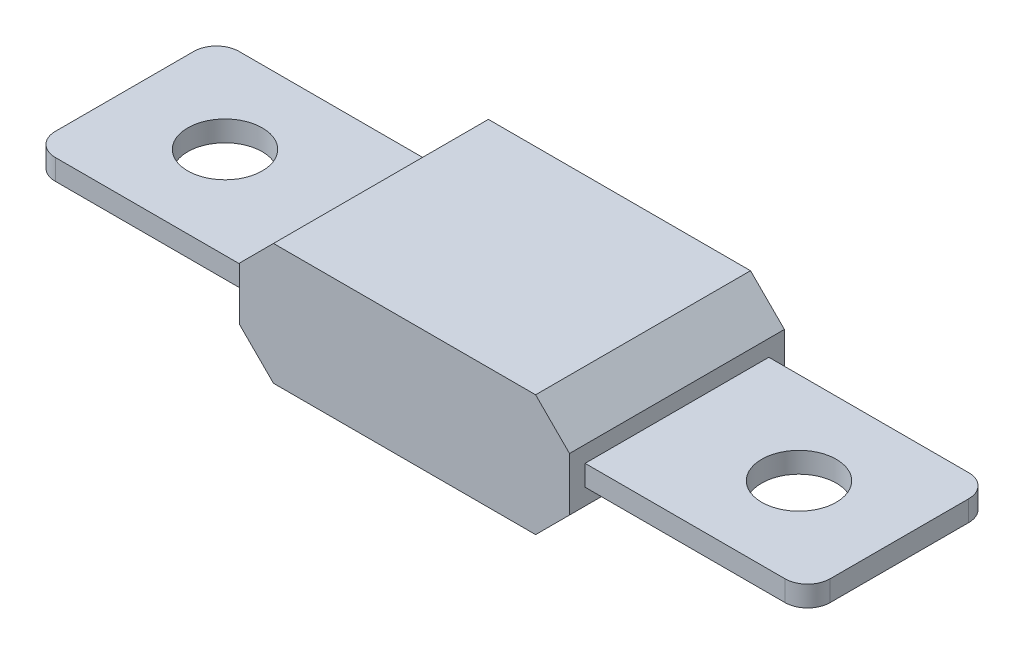
ISO-10303-21;
HEADER;
FILE_DESCRIPTION(('STEP AP214'),'2;1');
FILE_NAME('part.step','',(''),(''),'','','');
FILE_SCHEMA(('AUTOMOTIVE_DESIGN { 1 0 10303 214 1 1 1 1 }'));
ENDSEC;
DATA;
#1=APPLICATION_CONTEXT('core data for automotive mechanical design processes');
#2=APPLICATION_PROTOCOL_DEFINITION('international standard','automotive_design',2000,#1);
#3=PRODUCT_CONTEXT('',#1,'mechanical');
#4=PRODUCT('Part','Part','',(#3));
#5=PRODUCT_RELATED_PRODUCT_CATEGORY('part','',(#4));
#6=PRODUCT_DEFINITION_FORMATION('','',#4);
#7=PRODUCT_DEFINITION_CONTEXT('part definition',#1,'design');
#8=PRODUCT_DEFINITION('design','',#6,#7);
#9=PRODUCT_DEFINITION_SHAPE('','',#8);
#10=(LENGTH_UNIT() NAMED_UNIT(*) SI_UNIT(.MILLI.,.METRE.));
#11=(NAMED_UNIT(*) PLANE_ANGLE_UNIT() SI_UNIT($,.RADIAN.));
#12=(NAMED_UNIT(*) SI_UNIT($,.STERADIAN.) SOLID_ANGLE_UNIT());
#13=UNCERTAINTY_MEASURE_WITH_UNIT(LENGTH_MEASURE(1.E-05),#10,'distance_accuracy_value','');
#14=(GEOMETRIC_REPRESENTATION_CONTEXT(3) GLOBAL_UNCERTAINTY_ASSIGNED_CONTEXT((#13)) GLOBAL_UNIT_ASSIGNED_CONTEXT((#10,
#11,#12)) REPRESENTATION_CONTEXT('',''));
#15=CARTESIAN_POINT('',(0.,0.,0.));
#16=DIRECTION('',(0.,0.,1.));
#17=DIRECTION('',(1.,0.,0.));
#18=AXIS2_PLACEMENT_3D('',#15,#16,#17);
#19=CARTESIAN_POINT('',(-32.29,1.83,-6.13));
#20=DIRECTION('',(0.,1.,0.));
#21=DIRECTION('',(0.,0.,1.));
#22=AXIS2_PLACEMENT_3D('',#19,#20,#21);
#23=PLANE('',#22);
#24=DIRECTION('',(0.,0.,-1.));
#25=VECTOR('',#24,1.);
#26=CARTESIAN_POINT('',(14.6,1.83,-6.13));
#27=LINE('',#26,#25);
#28=CARTESIAN_POINT('',(14.6,1.83,8.13));
#29=VERTEX_POINT('',#28);
#30=CARTESIAN_POINT('',(14.6,1.83,-8.13));
#31=VERTEX_POINT('',#30);
#32=EDGE_CURVE('E47',#29,#31,#27,.T.);
#33=ORIENTED_EDGE('',*,*,#32,.F.);
#34=DIRECTION('',(1.,0.,0.));
#35=VECTOR('',#34,1.);
#36=CARTESIAN_POINT('',(-32.29,1.83,8.13));
#37=LINE('',#36,#35);
#38=CARTESIAN_POINT('',(32.29,1.83,8.13));
#39=VERTEX_POINT('',#38);
#40=EDGE_CURVE('E276',#29,#39,#37,.T.);
#41=ORIENTED_EDGE('',*,*,#40,.T.);
#42=CARTESIAN_POINT('',(32.29,1.83,6.13));
#43=DIRECTION('',(0.,1.,0.));
#44=DIRECTION('',(0.,0.,1.));
#45=AXIS2_PLACEMENT_3D('',#42,#43,#44);
#46=CIRCLE('',#45,2.);
#47=CARTESIAN_POINT('',(34.29,1.83,6.12999999999998));
#48=VERTEX_POINT('',#47);
#49=EDGE_CURVE('E280',#39,#48,#46,.T.);
#50=ORIENTED_EDGE('',*,*,#49,.T.);
#51=DIRECTION('',(0.,0.,-1.));
#52=VECTOR('',#51,1.);
#53=CARTESIAN_POINT('',(34.29,1.83,-6.12999999999999));
#54=LINE('',#53,#52);
#55=CARTESIAN_POINT('',(34.29,1.83,-6.12999999999999));
#56=VERTEX_POINT('',#55);
#57=EDGE_CURVE('E282',#48,#56,#54,.T.);
#58=ORIENTED_EDGE('',*,*,#57,.T.);
#59=CARTESIAN_POINT('',(32.29,1.83,-6.13));
#60=DIRECTION('',(0.,1.,0.));
#61=DIRECTION('',(0.,0.,-1.));
#62=AXIS2_PLACEMENT_3D('',#59,#60,#61);
#63=CIRCLE('',#62,2.);
#64=CARTESIAN_POINT('',(32.29,1.83,-8.13));
#65=VERTEX_POINT('',#64);
#66=EDGE_CURVE('E284',#56,#65,#63,.T.);
#67=ORIENTED_EDGE('',*,*,#66,.T.);
#68=DIRECTION('',(-1.,0.,0.));
#69=VECTOR('',#68,1.);
#70=CARTESIAN_POINT('',(-32.29,1.83,-8.13));
#71=LINE('',#70,#69);
#72=EDGE_CURVE('E287',#65,#31,#71,.T.);
#73=ORIENTED_EDGE('',*,*,#72,.T.);
#74=EDGE_LOOP('',(#33,#41,#50,#58,#67,#73));
#75=FACE_BOUND('',#74,.T.);
#76=CARTESIAN_POINT('',(25.4,1.83,0.));
#77=DIRECTION('',(0.,1.,0.));
#78=DIRECTION('',(0.,0.,1.));
#79=AXIS2_PLACEMENT_3D('',#76,#77,#78);
#80=CIRCLE('',#79,3.3);
#81=CARTESIAN_POINT('',(25.4,1.83,3.3));
#82=VERTEX_POINT('',#81);
#83=EDGE_CURVE('E262',#82,#82,#80,.T.);
#84=ORIENTED_EDGE('',*,*,#83,.F.);
#85=EDGE_LOOP('',(#84));
#86=FACE_BOUND('',#85,.T.);
#87=ADVANCED_FACE('F32',(#75,#86),#23,.T.);
#88=CARTESIAN_POINT('',(-32.29,0.,-6.13));
#89=DIRECTION('',(0.,1.,0.));
#90=DIRECTION('',(0.,0.,1.));
#91=AXIS2_PLACEMENT_3D('',#88,#89,#90);
#92=PLANE('',#91);
#93=CARTESIAN_POINT('',(25.4,0.,0.));
#94=DIRECTION('',(0.,1.,0.));
#95=DIRECTION('',(0.,0.,1.));
#96=AXIS2_PLACEMENT_3D('',#93,#94,#95);
#97=CIRCLE('',#96,3.3);
#98=CARTESIAN_POINT('',(25.4,0.,3.3));
#99=VERTEX_POINT('',#98);
#100=EDGE_CURVE('E259',#99,#99,#97,.T.);
#101=ORIENTED_EDGE('',*,*,#100,.T.);
#102=EDGE_LOOP('',(#101));
#103=FACE_BOUND('',#102,.T.);
#104=DIRECTION('',(1.,0.,0.));
#105=VECTOR('',#104,1.);
#106=CARTESIAN_POINT('',(-32.29,0.,8.13));
#107=LINE('',#106,#105);
#108=CARTESIAN_POINT('',(14.6,0.,8.13));
#109=VERTEX_POINT('',#108);
#110=CARTESIAN_POINT('',(32.29,0.,8.13));
#111=VERTEX_POINT('',#110);
#112=EDGE_CURVE('E297',#109,#111,#107,.T.);
#113=ORIENTED_EDGE('',*,*,#112,.F.);
#114=DIRECTION('',(0.,0.,-1.));
#115=VECTOR('',#114,1.);
#116=CARTESIAN_POINT('',(14.6,0.,-6.13));
#117=LINE('',#116,#115);
#118=CARTESIAN_POINT('',(14.6,0.,-8.13));
#119=VERTEX_POINT('',#118);
#120=EDGE_CURVE('E248',#109,#119,#117,.T.);
#121=ORIENTED_EDGE('',*,*,#120,.T.);
#122=DIRECTION('',(-1.,0.,0.));
#123=VECTOR('',#122,1.);
#124=CARTESIAN_POINT('',(-32.29,0.,-8.13));
#125=LINE('',#124,#123);
#126=CARTESIAN_POINT('',(32.29,0.,-8.13));
#127=VERTEX_POINT('',#126);
#128=EDGE_CURVE('E272',#127,#119,#125,.T.);
#129=ORIENTED_EDGE('',*,*,#128,.F.);
#130=CARTESIAN_POINT('',(32.29,0.,-6.13));
#131=DIRECTION('',(0.,1.,0.));
#132=DIRECTION('',(0.,0.,-1.));
#133=AXIS2_PLACEMENT_3D('',#130,#131,#132);
#134=CIRCLE('',#133,2.);
#135=CARTESIAN_POINT('',(34.29,0.,-6.12999999999999));
#136=VERTEX_POINT('',#135);
#137=EDGE_CURVE('E305',#136,#127,#134,.T.);
#138=ORIENTED_EDGE('',*,*,#137,.F.);
#139=DIRECTION('',(0.,0.,-1.));
#140=VECTOR('',#139,1.);
#141=CARTESIAN_POINT('',(34.29,0.,-6.12999999999999));
#142=LINE('',#141,#140);
#143=CARTESIAN_POINT('',(34.29,0.,6.12999999999998));
#144=VERTEX_POINT('',#143);
#145=EDGE_CURVE('E303',#144,#136,#142,.T.);
#146=ORIENTED_EDGE('',*,*,#145,.F.);
#147=CARTESIAN_POINT('',(32.29,0.,6.13));
#148=DIRECTION('',(0.,1.,0.));
#149=DIRECTION('',(0.,0.,1.));
#150=AXIS2_PLACEMENT_3D('',#147,#148,#149);
#151=CIRCLE('',#150,2.);
#152=EDGE_CURVE('E301',#111,#144,#151,.T.);
#153=ORIENTED_EDGE('',*,*,#152,.F.);
#154=EDGE_LOOP('',(#113,#121,#129,#138,#146,#153));
#155=FACE_BOUND('',#154,.T.);
#156=ADVANCED_FACE('F371',(#103,#155),#92,.F.);
#157=CARTESIAN_POINT('',(-32.29,1.83,8.13));
#158=DIRECTION('',(0.,0.,-1.));
#159=DIRECTION('',(-1.,0.,0.));
#160=AXIS2_PLACEMENT_3D('',#157,#158,#159);
#161=PLANE('',#160);
#162=ORIENTED_EDGE('',*,*,#40,.F.);
#163=DIRECTION('',(0.,-1.,0.));
#164=VECTOR('',#163,1.);
#165=CARTESIAN_POINT('',(14.6,1.83000000000002,8.13));
#166=LINE('',#165,#164);
#167=EDGE_CURVE('E252',#29,#109,#166,.T.);
#168=ORIENTED_EDGE('',*,*,#167,.T.);
#169=ORIENTED_EDGE('',*,*,#112,.T.);
#170=DIRECTION('',(0.,-1.,0.));
#171=VECTOR('',#170,1.);
#172=CARTESIAN_POINT('',(32.29,1.83,8.13));
#173=LINE('',#172,#171);
#174=EDGE_CURVE('E321',#39,#111,#173,.T.);
#175=ORIENTED_EDGE('',*,*,#174,.F.);
#176=EDGE_LOOP('',(#162,#168,#169,#175));
#177=FACE_BOUND('',#176,.T.);
#178=ADVANCED_FACE('F377',(#177),#161,.F.);
#179=CARTESIAN_POINT('',(-32.29,1.83,-8.13));
#180=DIRECTION('',(0.,0.,1.));
#181=DIRECTION('',(1.,0.,0.));
#182=AXIS2_PLACEMENT_3D('',#179,#180,#181);
#183=PLANE('',#182);
#184=ORIENTED_EDGE('',*,*,#128,.T.);
#185=DIRECTION('',(0.,1.,0.));
#186=VECTOR('',#185,1.);
#187=CARTESIAN_POINT('',(14.6,1.83000000000002,-8.13));
#188=LINE('',#187,#186);
#189=EDGE_CURVE('E11',#119,#31,#188,.T.);
#190=ORIENTED_EDGE('',*,*,#189,.T.);
#191=ORIENTED_EDGE('',*,*,#72,.F.);
#192=DIRECTION('',(0.,-1.,0.));
#193=VECTOR('',#192,1.);
#194=CARTESIAN_POINT('',(32.29,1.83,-8.13));
#195=LINE('',#194,#193);
#196=EDGE_CURVE('E312',#65,#127,#195,.T.);
#197=ORIENTED_EDGE('',*,*,#196,.T.);
#198=EDGE_LOOP('',(#184,#190,#191,#197));
#199=FACE_BOUND('',#198,.T.);
#200=ADVANCED_FACE('F390',(#199),#183,.F.);
#201=CARTESIAN_POINT('',(32.29,1.83,6.13));
#202=DIRECTION('',(0.,-1.,0.));
#203=DIRECTION('',(0.,0.,-1.));
#204=AXIS2_PLACEMENT_3D('',#201,#202,#203);
#205=CYLINDRICAL_SURFACE('',#204,2.);
#206=ORIENTED_EDGE('',*,*,#152,.T.);
#207=DIRECTION('',(0.,-1.,0.));
#208=VECTOR('',#207,1.);
#209=CARTESIAN_POINT('',(34.29,1.83,6.12999999999998));
#210=LINE('',#209,#208);
#211=EDGE_CURVE('E318',#48,#144,#210,.T.);
#212=ORIENTED_EDGE('',*,*,#211,.F.);
#213=ORIENTED_EDGE('',*,*,#49,.F.);
#214=ORIENTED_EDGE('',*,*,#174,.T.);
#215=EDGE_LOOP('',(#206,#212,#213,#214));
#216=FACE_BOUND('',#215,.T.);
#217=ADVANCED_FACE('F400',(#216),#205,.T.);
#218=CARTESIAN_POINT('',(34.29,1.83,-6.12999999999999));
#219=DIRECTION('',(-1.,0.,0.));
#220=DIRECTION('',(0.,0.,1.));
#221=AXIS2_PLACEMENT_3D('',#218,#219,#220);
#222=PLANE('',#221);
#223=ORIENTED_EDGE('',*,*,#145,.T.);
#224=DIRECTION('',(0.,-1.,0.));
#225=VECTOR('',#224,1.);
#226=CARTESIAN_POINT('',(34.29,1.83,-6.12999999999999));
#227=LINE('',#226,#225);
#228=EDGE_CURVE('E315',#56,#136,#227,.T.);
#229=ORIENTED_EDGE('',*,*,#228,.F.);
#230=ORIENTED_EDGE('',*,*,#57,.F.);
#231=ORIENTED_EDGE('',*,*,#211,.T.);
#232=EDGE_LOOP('',(#223,#229,#230,#231));
#233=FACE_BOUND('',#232,.T.);
#234=ADVANCED_FACE('F396',(#233),#222,.F.);
#235=CARTESIAN_POINT('',(32.29,1.83,-6.13));
#236=DIRECTION('',(0.,-1.,0.));
#237=DIRECTION('',(0.,0.,-1.));
#238=AXIS2_PLACEMENT_3D('',#235,#236,#237);
#239=CYLINDRICAL_SURFACE('',#238,2.);
#240=ORIENTED_EDGE('',*,*,#137,.T.);
#241=ORIENTED_EDGE('',*,*,#196,.F.);
#242=ORIENTED_EDGE('',*,*,#66,.F.);
#243=ORIENTED_EDGE('',*,*,#228,.T.);
#244=EDGE_LOOP('',(#240,#241,#242,#243));
#245=FACE_BOUND('',#244,.T.);
#246=ADVANCED_FACE('F392',(#245),#239,.T.);
#247=CARTESIAN_POINT('',(25.4,1.83,0.));
#248=DIRECTION('',(0.,-1.,0.));
#249=DIRECTION('',(0.,0.,-1.));
#250=AXIS2_PLACEMENT_3D('',#247,#248,#249);
#251=CYLINDRICAL_SURFACE('',#250,3.3);
#252=ORIENTED_EDGE('',*,*,#83,.T.);
#253=EDGE_LOOP('',(#252));
#254=FACE_BOUND('',#253,.T.);
#255=ORIENTED_EDGE('',*,*,#100,.F.);
#256=EDGE_LOOP('',(#255));
#257=FACE_BOUND('',#256,.T.);
#258=ADVANCED_FACE('F395',(#254,#257),#251,.F.);
#259=CARTESIAN_POINT('',(14.6,3.275,-9.51));
#260=DIRECTION('',(1.,0.,0.));
#261=DIRECTION('',(0.,1.,0.));
#262=AXIS2_PLACEMENT_3D('',#259,#260,#261);
#263=PLANE('',#262);
#264=DIRECTION('',(0.,0.,1.));
#265=VECTOR('',#264,1.);
#266=CARTESIAN_POINT('',(14.6,3.275,-9.51));
#267=LINE('',#266,#265);
#268=CARTESIAN_POINT('',(14.6,3.275,-9.51));
#269=VERTEX_POINT('',#268);
#270=CARTESIAN_POINT('',(14.6,3.275,9.51));
#271=VERTEX_POINT('',#270);
#272=EDGE_CURVE('E231',#269,#271,#267,.T.);
#273=ORIENTED_EDGE('',*,*,#272,.T.);
#274=DIRECTION('',(0.,1.,0.));
#275=VECTOR('',#274,1.);
#276=CARTESIAN_POINT('',(14.6,3.275,9.51));
#277=LINE('',#276,#275);
#278=CARTESIAN_POINT('',(14.6,-1.445,9.51));
#279=VERTEX_POINT('',#278);
#280=EDGE_CURVE('E206',#279,#271,#277,.T.);
#281=ORIENTED_EDGE('',*,*,#280,.F.);
#282=DIRECTION('',(0.,0.,1.));
#283=VECTOR('',#282,1.);
#284=CARTESIAN_POINT('',(14.6,-1.445,-9.51));
#285=LINE('',#284,#283);
#286=CARTESIAN_POINT('',(14.6,-1.445,-9.51));
#287=VERTEX_POINT('',#286);
#288=EDGE_CURVE('E233',#287,#279,#285,.T.);
#289=ORIENTED_EDGE('',*,*,#288,.F.);
#290=DIRECTION('',(0.,1.,0.));
#291=VECTOR('',#290,1.);
#292=CARTESIAN_POINT('',(14.6,3.275,-9.51));
#293=LINE('',#292,#291);
#294=EDGE_CURVE('E224',#287,#269,#293,.T.);
#295=ORIENTED_EDGE('',*,*,#294,.T.);
#296=EDGE_LOOP('',(#273,#281,#289,#295));
#297=FACE_BOUND('',#296,.T.);
#298=ORIENTED_EDGE('',*,*,#167,.F.);
#299=ORIENTED_EDGE('',*,*,#32,.T.);
#300=ORIENTED_EDGE('',*,*,#189,.F.);
#301=ORIENTED_EDGE('',*,*,#120,.F.);
#302=EDGE_LOOP('',(#298,#299,#300,#301));
#303=FACE_BOUND('',#302,.T.);
#304=ADVANCED_FACE('F424',(#297,#303),#263,.T.);
#305=CARTESIAN_POINT('',(-14.6,3.275,-9.51));
#306=DIRECTION('',(-1.,0.,0.));
#307=DIRECTION('',(0.,-1.,0.));
#308=AXIS2_PLACEMENT_3D('',#305,#306,#307);
#309=PLANE('',#308);
#310=DIRECTION('',(0.,0.,1.));
#311=VECTOR('',#310,1.);
#312=CARTESIAN_POINT('',(-14.6,-1.445,-9.51));
#313=LINE('',#312,#311);
#314=CARTESIAN_POINT('',(-14.6,-1.445,-9.51));
#315=VERTEX_POINT('',#314);
#316=CARTESIAN_POINT('',(-14.6,-1.445,9.51));
#317=VERTEX_POINT('',#316);
#318=EDGE_CURVE('E239',#315,#317,#313,.T.);
#319=ORIENTED_EDGE('',*,*,#318,.T.);
#320=DIRECTION('',(0.,-1.,0.));
#321=VECTOR('',#320,1.);
#322=CARTESIAN_POINT('',(-14.6,3.275,9.51));
#323=LINE('',#322,#321);
#324=CARTESIAN_POINT('',(-14.6,3.275,9.51));
#325=VERTEX_POINT('',#324);
#326=EDGE_CURVE('E187',#325,#317,#323,.T.);
#327=ORIENTED_EDGE('',*,*,#326,.F.);
#328=DIRECTION('',(0.,0.,1.));
#329=VECTOR('',#328,1.);
#330=CARTESIAN_POINT('',(-14.6,3.275,-9.51));
#331=LINE('',#330,#329);
#332=CARTESIAN_POINT('',(-14.6,3.275,-9.51));
#333=VERTEX_POINT('',#332);
#334=EDGE_CURVE('E178',#333,#325,#331,.T.);
#335=ORIENTED_EDGE('',*,*,#334,.F.);
#336=DIRECTION('',(0.,-1.,0.));
#337=VECTOR('',#336,1.);
#338=CARTESIAN_POINT('',(-14.6,3.275,-9.51));
#339=LINE('',#338,#337);
#340=EDGE_CURVE('E212',#333,#315,#339,.T.);
#341=ORIENTED_EDGE('',*,*,#340,.T.);
#342=EDGE_LOOP('',(#319,#327,#335,#341));
#343=FACE_BOUND('',#342,.T.);
#344=DIRECTION('',(0.,1.,0.));
#345=VECTOR('',#344,1.);
#346=CARTESIAN_POINT('',(-14.6,1.83000000000001,8.13));
#347=LINE('',#346,#345);
#348=CARTESIAN_POINT('',(-14.6,0.,8.13));
#349=VERTEX_POINT('',#348);
#350=CARTESIAN_POINT('',(-14.6,1.83,8.13));
#351=VERTEX_POINT('',#350);
#352=EDGE_CURVE('E245',#349,#351,#347,.T.);
#353=ORIENTED_EDGE('',*,*,#352,.F.);
#354=DIRECTION('',(0.,0.,1.));
#355=VECTOR('',#354,1.);
#356=CARTESIAN_POINT('',(-14.6,0.,-6.13));
#357=LINE('',#356,#355);
#358=CARTESIAN_POINT('',(-14.6,0.,-8.13));
#359=VERTEX_POINT('',#358);
#360=EDGE_CURVE('E54',#359,#349,#357,.T.);
#361=ORIENTED_EDGE('',*,*,#360,.F.);
#362=DIRECTION('',(0.,-1.,0.));
#363=VECTOR('',#362,1.);
#364=CARTESIAN_POINT('',(-14.6,1.83000000000001,-8.13));
#365=LINE('',#364,#363);
#366=CARTESIAN_POINT('',(-14.6,1.83,-8.13));
#367=VERTEX_POINT('',#366);
#368=EDGE_CURVE('E40',#367,#359,#365,.T.);
#369=ORIENTED_EDGE('',*,*,#368,.F.);
#370=DIRECTION('',(0.,0.,1.));
#371=VECTOR('',#370,1.);
#372=CARTESIAN_POINT('',(-14.6,1.83,-6.13));
#373=LINE('',#372,#371);
#374=EDGE_CURVE('E243',#367,#351,#373,.T.);
#375=ORIENTED_EDGE('',*,*,#374,.T.);
#376=EDGE_LOOP('',(#353,#361,#369,#375));
#377=FACE_BOUND('',#376,.T.);
#378=ADVANCED_FACE('F352',(#343,#377),#309,.T.);
#379=CARTESIAN_POINT('',(-11.6,6.275,-9.51));
#380=DIRECTION('',(0.,1.,0.));
#381=DIRECTION('',(0.,0.,1.));
#382=AXIS2_PLACEMENT_3D('',#379,#380,#381);
#383=PLANE('',#382);
#384=DIRECTION('',(0.,0.,1.));
#385=VECTOR('',#384,1.);
#386=CARTESIAN_POINT('',(-11.6,6.275,-9.51));
#387=LINE('',#386,#385);
#388=CARTESIAN_POINT('',(-11.6,6.275,-9.51));
#389=VERTEX_POINT('',#388);
#390=CARTESIAN_POINT('',(-11.6,6.275,9.51));
#391=VERTEX_POINT('',#390);
#392=EDGE_CURVE('E168',#389,#391,#387,.T.);
#393=ORIENTED_EDGE('',*,*,#392,.T.);
#394=DIRECTION('',(-1.,0.,0.));
#395=VECTOR('',#394,1.);
#396=CARTESIAN_POINT('',(-11.6,6.275,9.51));
#397=LINE('',#396,#395);
#398=CARTESIAN_POINT('',(11.6,6.275,9.51));
#399=VERTEX_POINT('',#398);
#400=EDGE_CURVE('E172',#399,#391,#397,.T.);
#401=ORIENTED_EDGE('',*,*,#400,.F.);
#402=DIRECTION('',(0.,0.,1.));
#403=VECTOR('',#402,1.);
#404=CARTESIAN_POINT('',(11.6,6.275,-9.51));
#405=LINE('',#404,#403);
#406=CARTESIAN_POINT('',(11.6,6.275,-9.51));
#407=VERTEX_POINT('',#406);
#408=EDGE_CURVE('E229',#407,#399,#405,.T.);
#409=ORIENTED_EDGE('',*,*,#408,.F.);
#410=DIRECTION('',(-1.,0.,0.));
#411=VECTOR('',#410,1.);
#412=CARTESIAN_POINT('',(-11.6,6.275,-9.51));
#413=LINE('',#412,#411);
#414=EDGE_CURVE('E174',#407,#389,#413,.T.);
#415=ORIENTED_EDGE('',*,*,#414,.T.);
#416=EDGE_LOOP('',(#393,#401,#409,#415));
#417=FACE_BOUND('',#416,.T.);
#418=ADVANCED_FACE('F170',(#417),#383,.T.);
#419=CARTESIAN_POINT('',(11.6,6.275,-9.51));
#420=DIRECTION('',(0.707106781186547,0.707106781186548,0.));
#421=DIRECTION('',(-0.707106781186548,0.707106781186547,0.));
#422=AXIS2_PLACEMENT_3D('',#419,#420,#421);
#423=PLANE('',#422);
#424=ORIENTED_EDGE('',*,*,#408,.T.);
#425=DIRECTION('',(-0.707106781186548,0.707106781186547,0.));
#426=VECTOR('',#425,1.);
#427=CARTESIAN_POINT('',(11.6,6.275,9.51));
#428=LINE('',#427,#426);
#429=EDGE_CURVE('E193',#271,#399,#428,.T.);
#430=ORIENTED_EDGE('',*,*,#429,.F.);
#431=ORIENTED_EDGE('',*,*,#272,.F.);
#432=DIRECTION('',(-0.707106781186548,0.707106781186547,0.));
#433=VECTOR('',#432,1.);
#434=CARTESIAN_POINT('',(11.6,6.275,-9.51));
#435=LINE('',#434,#433);
#436=EDGE_CURVE('E179',#269,#407,#435,.T.);
#437=ORIENTED_EDGE('',*,*,#436,.T.);
#438=EDGE_LOOP('',(#424,#430,#431,#437));
#439=FACE_BOUND('',#438,.T.);
#440=ADVANCED_FACE('F443',(#439),#423,.T.);
#441=CARTESIAN_POINT('',(11.6,-4.445,-9.51));
#442=DIRECTION('',(0.707106781186548,-0.707106781186547,0.));
#443=DIRECTION('',(0.707106781186547,0.707106781186548,0.));
#444=AXIS2_PLACEMENT_3D('',#441,#442,#443);
#445=PLANE('',#444);
#446=ORIENTED_EDGE('',*,*,#288,.T.);
#447=DIRECTION('',(0.707106781186547,0.707106781186548,0.));
#448=VECTOR('',#447,1.);
#449=CARTESIAN_POINT('',(11.6,-4.445,9.51));
#450=LINE('',#449,#448);
#451=CARTESIAN_POINT('',(11.6,-4.445,9.51));
#452=VERTEX_POINT('',#451);
#453=EDGE_CURVE('E203',#452,#279,#450,.T.);
#454=ORIENTED_EDGE('',*,*,#453,.F.);
#455=DIRECTION('',(0.,0.,1.));
#456=VECTOR('',#455,1.);
#457=CARTESIAN_POINT('',(11.6,-4.445,-9.51));
#458=LINE('',#457,#456);
#459=CARTESIAN_POINT('',(11.6,-4.445,-9.51));
#460=VERTEX_POINT('',#459);
#461=EDGE_CURVE('E235',#460,#452,#458,.T.);
#462=ORIENTED_EDGE('',*,*,#461,.F.);
#463=DIRECTION('',(0.707106781186547,0.707106781186548,0.));
#464=VECTOR('',#463,1.);
#465=CARTESIAN_POINT('',(11.6,-4.445,-9.51));
#466=LINE('',#465,#464);
#467=EDGE_CURVE('E221',#460,#287,#466,.T.);
#468=ORIENTED_EDGE('',*,*,#467,.T.);
#469=EDGE_LOOP('',(#446,#454,#462,#468));
#470=FACE_BOUND('',#469,.T.);
#471=ADVANCED_FACE('F445',(#470),#445,.T.);
#472=CARTESIAN_POINT('',(-11.6,-4.445,-9.51));
#473=DIRECTION('',(0.,-1.,0.));
#474=DIRECTION('',(1.,0.,0.));
#475=AXIS2_PLACEMENT_3D('',#472,#473,#474);
#476=PLANE('',#475);
#477=ORIENTED_EDGE('',*,*,#461,.T.);
#478=DIRECTION('',(1.,0.,0.));
#479=VECTOR('',#478,1.);
#480=CARTESIAN_POINT('',(-11.6,-4.445,9.51));
#481=LINE('',#480,#479);
#482=CARTESIAN_POINT('',(-11.6,-4.445,9.51));
#483=VERTEX_POINT('',#482);
#484=EDGE_CURVE('E200',#483,#452,#481,.T.);
#485=ORIENTED_EDGE('',*,*,#484,.F.);
#486=DIRECTION('',(0.,0.,1.));
#487=VECTOR('',#486,1.);
#488=CARTESIAN_POINT('',(-11.6,-4.445,-9.51));
#489=LINE('',#488,#487);
#490=CARTESIAN_POINT('',(-11.6,-4.445,-9.51));
#491=VERTEX_POINT('',#490);
#492=EDGE_CURVE('E237',#491,#483,#489,.T.);
#493=ORIENTED_EDGE('',*,*,#492,.F.);
#494=DIRECTION('',(1.,0.,0.));
#495=VECTOR('',#494,1.);
#496=CARTESIAN_POINT('',(-11.6,-4.445,-9.51));
#497=LINE('',#496,#495);
#498=EDGE_CURVE('E218',#491,#460,#497,.T.);
#499=ORIENTED_EDGE('',*,*,#498,.T.);
#500=EDGE_LOOP('',(#477,#485,#493,#499));
#501=FACE_BOUND('',#500,.T.);
#502=ADVANCED_FACE('F448',(#501),#476,.T.);
#503=CARTESIAN_POINT('',(-14.6,-1.445,-9.51));
#504=DIRECTION('',(-0.707106781186548,-0.707106781186547,0.));
#505=DIRECTION('',(0.707106781186547,-0.707106781186548,0.));
#506=AXIS2_PLACEMENT_3D('',#503,#504,#505);
#507=PLANE('',#506);
#508=ORIENTED_EDGE('',*,*,#492,.T.);
#509=DIRECTION('',(0.707106781186547,-0.707106781186548,0.));
#510=VECTOR('',#509,1.);
#511=CARTESIAN_POINT('',(-14.6,-1.445,9.51));
#512=LINE('',#511,#510);
#513=EDGE_CURVE('E197',#317,#483,#512,.T.);
#514=ORIENTED_EDGE('',*,*,#513,.F.);
#515=ORIENTED_EDGE('',*,*,#318,.F.);
#516=DIRECTION('',(0.707106781186547,-0.707106781186548,0.));
#517=VECTOR('',#516,1.);
#518=CARTESIAN_POINT('',(-14.6,-1.445,-9.51));
#519=LINE('',#518,#517);
#520=EDGE_CURVE('E215',#315,#491,#519,.T.);
#521=ORIENTED_EDGE('',*,*,#520,.T.);
#522=EDGE_LOOP('',(#508,#514,#515,#521));
#523=FACE_BOUND('',#522,.T.);
#524=ADVANCED_FACE('F452',(#523),#507,.T.);
#525=CARTESIAN_POINT('',(-14.6,3.275,-9.51));
#526=DIRECTION('',(-0.707106781186548,0.707106781186547,0.));
#527=DIRECTION('',(-0.707106781186547,-0.707106781186548,0.));
#528=AXIS2_PLACEMENT_3D('',#525,#526,#527);
#529=PLANE('',#528);
#530=ORIENTED_EDGE('',*,*,#334,.T.);
#531=DIRECTION('',(-0.707106781186547,-0.707106781186548,0.));
#532=VECTOR('',#531,1.);
#533=CARTESIAN_POINT('',(-14.6,3.275,9.51));
#534=LINE('',#533,#532);
#535=EDGE_CURVE('E182',#391,#325,#534,.T.);
#536=ORIENTED_EDGE('',*,*,#535,.F.);
#537=ORIENTED_EDGE('',*,*,#392,.F.);
#538=DIRECTION('',(-0.707106781186547,-0.707106781186548,0.));
#539=VECTOR('',#538,1.);
#540=CARTESIAN_POINT('',(-14.6,3.275,-9.51));
#541=LINE('',#540,#539);
#542=EDGE_CURVE('E210',#389,#333,#541,.T.);
#543=ORIENTED_EDGE('',*,*,#542,.T.);
#544=EDGE_LOOP('',(#530,#536,#537,#543));
#545=FACE_BOUND('',#544,.T.);
#546=ADVANCED_FACE('F183',(#545),#529,.T.);
#547=CARTESIAN_POINT('',(0.,0.,-9.51));
#548=DIRECTION('',(0.,0.,-1.));
#549=DIRECTION('',(-1.,0.,0.));
#550=AXIS2_PLACEMENT_3D('',#547,#548,#549);
#551=PLANE('',#550);
#552=ORIENTED_EDGE('',*,*,#414,.F.);
#553=ORIENTED_EDGE('',*,*,#436,.F.);
#554=ORIENTED_EDGE('',*,*,#294,.F.);
#555=ORIENTED_EDGE('',*,*,#467,.F.);
#556=ORIENTED_EDGE('',*,*,#498,.F.);
#557=ORIENTED_EDGE('',*,*,#520,.F.);
#558=ORIENTED_EDGE('',*,*,#340,.F.);
#559=ORIENTED_EDGE('',*,*,#542,.F.);
#560=EDGE_LOOP('',(#552,#553,#554,#555,#556,#557,#558,#559));
#561=FACE_BOUND('',#560,.T.);
#562=ADVANCED_FACE('F459',(#561),#551,.T.);
#563=CARTESIAN_POINT('',(0.,0.,9.51));
#564=DIRECTION('',(0.,0.,-1.));
#565=DIRECTION('',(-1.,0.,0.));
#566=AXIS2_PLACEMENT_3D('',#563,#564,#565);
#567=PLANE('',#566);
#568=ORIENTED_EDGE('',*,*,#400,.T.);
#569=ORIENTED_EDGE('',*,*,#535,.T.);
#570=ORIENTED_EDGE('',*,*,#326,.T.);
#571=ORIENTED_EDGE('',*,*,#513,.T.);
#572=ORIENTED_EDGE('',*,*,#484,.T.);
#573=ORIENTED_EDGE('',*,*,#453,.T.);
#574=ORIENTED_EDGE('',*,*,#280,.T.);
#575=ORIENTED_EDGE('',*,*,#429,.T.);
#576=EDGE_LOOP('',(#568,#569,#570,#571,#572,#573,#574,#575));
#577=FACE_BOUND('',#576,.T.);
#578=ADVANCED_FACE('F190',(#577),#567,.F.);
#579=CARTESIAN_POINT('',(-25.4,1.83,0.));
#580=DIRECTION('',(0.,-1.,0.));
#581=DIRECTION('',(0.,0.,-1.));
#582=AXIS2_PLACEMENT_3D('',#579,#580,#581);
#583=CYLINDRICAL_SURFACE('',#582,3.3);
#584=CARTESIAN_POINT('',(-25.4,1.83,0.));
#585=DIRECTION('',(0.,1.,0.));
#586=DIRECTION('',(0.,0.,-1.));
#587=AXIS2_PLACEMENT_3D('',#584,#585,#586);
#588=CIRCLE('',#587,3.3);
#589=CARTESIAN_POINT('',(-25.4,1.83,-3.3));
#590=VERTEX_POINT('',#589);
#591=EDGE_CURVE('E256',#590,#590,#588,.T.);
#592=ORIENTED_EDGE('',*,*,#591,.T.);
#593=EDGE_LOOP('',(#592));
#594=FACE_BOUND('',#593,.T.);
#595=CARTESIAN_POINT('',(-25.4,0.,0.));
#596=DIRECTION('',(0.,1.,0.));
#597=DIRECTION('',(0.,0.,-1.));
#598=AXIS2_PLACEMENT_3D('',#595,#596,#597);
#599=CIRCLE('',#598,3.3);
#600=CARTESIAN_POINT('',(-25.4,0.,-3.3));
#601=VERTEX_POINT('',#600);
#602=EDGE_CURVE('E255',#601,#601,#599,.T.);
#603=ORIENTED_EDGE('',*,*,#602,.F.);
#604=EDGE_LOOP('',(#603));
#605=FACE_BOUND('',#604,.T.);
#606=ADVANCED_FACE('F362',(#594,#605),#583,.F.);
#607=CARTESIAN_POINT('',(-34.29,1.83,-6.12999999999999));
#608=DIRECTION('',(1.,0.,0.));
#609=DIRECTION('',(0.,0.,-1.));
#610=AXIS2_PLACEMENT_3D('',#607,#608,#609);
#611=PLANE('',#610);
#612=DIRECTION('',(0.,0.,1.));
#613=VECTOR('',#612,1.);
#614=CARTESIAN_POINT('',(-34.29,0.,-6.12999999999999));
#615=LINE('',#614,#613);
#616=CARTESIAN_POINT('',(-34.29,0.,-6.12999999999999));
#617=VERTEX_POINT('',#616);
#618=CARTESIAN_POINT('',(-34.29,0.,6.12999999999998));
#619=VERTEX_POINT('',#618);
#620=EDGE_CURVE('E293',#617,#619,#615,.T.);
#621=ORIENTED_EDGE('',*,*,#620,.T.);
#622=DIRECTION('',(0.,-1.,0.));
#623=VECTOR('',#622,1.);
#624=CARTESIAN_POINT('',(-34.29,1.83,6.12999999999998));
#625=LINE('',#624,#623);
#626=CARTESIAN_POINT('',(-34.29,1.83,6.12999999999998));
#627=VERTEX_POINT('',#626);
#628=EDGE_CURVE('E327',#627,#619,#625,.T.);
#629=ORIENTED_EDGE('',*,*,#628,.F.);
#630=DIRECTION('',(0.,0.,1.));
#631=VECTOR('',#630,1.);
#632=CARTESIAN_POINT('',(-34.29,1.83,-6.12999999999999));
#633=LINE('',#632,#631);
#634=CARTESIAN_POINT('',(-34.29,1.83,-6.12999999999999));
#635=VERTEX_POINT('',#634);
#636=EDGE_CURVE('E271',#635,#627,#633,.T.);
#637=ORIENTED_EDGE('',*,*,#636,.F.);
#638=DIRECTION('',(0.,-1.,0.));
#639=VECTOR('',#638,1.);
#640=CARTESIAN_POINT('',(-34.29,1.83,-6.12999999999999));
#641=LINE('',#640,#639);
#642=EDGE_CURVE('E330',#635,#617,#641,.T.);
#643=ORIENTED_EDGE('',*,*,#642,.T.);
#644=EDGE_LOOP('',(#621,#629,#637,#643));
#645=FACE_BOUND('',#644,.T.);
#646=ADVANCED_FACE('F360',(#645),#611,.F.);
#647=CARTESIAN_POINT('',(-32.29,1.83,6.13));
#648=DIRECTION('',(0.,-1.,0.));
#649=DIRECTION('',(0.,0.,-1.));
#650=AXIS2_PLACEMENT_3D('',#647,#648,#649);
#651=CYLINDRICAL_SURFACE('',#650,2.);
#652=CARTESIAN_POINT('',(-32.29,0.,6.13));
#653=DIRECTION('',(0.,1.,0.));
#654=DIRECTION('',(0.,0.,1.));
#655=AXIS2_PLACEMENT_3D('',#652,#653,#654);
#656=CIRCLE('',#655,2.);
#657=CARTESIAN_POINT('',(-32.29,0.,8.13));
#658=VERTEX_POINT('',#657);
#659=EDGE_CURVE('E295',#619,#658,#656,.T.);
#660=ORIENTED_EDGE('',*,*,#659,.T.);
#661=DIRECTION('',(0.,-1.,0.));
#662=VECTOR('',#661,1.);
#663=CARTESIAN_POINT('',(-32.29,1.83,8.13));
#664=LINE('',#663,#662);
#665=CARTESIAN_POINT('',(-32.29,1.83,8.13));
#666=VERTEX_POINT('',#665);
#667=EDGE_CURVE('E324',#666,#658,#664,.T.);
#668=ORIENTED_EDGE('',*,*,#667,.F.);
#669=CARTESIAN_POINT('',(-32.29,1.83,6.13));
#670=DIRECTION('',(0.,1.,0.));
#671=DIRECTION('',(0.,0.,1.));
#672=AXIS2_PLACEMENT_3D('',#669,#670,#671);
#673=CIRCLE('',#672,2.);
#674=EDGE_CURVE('E274',#627,#666,#673,.T.);
#675=ORIENTED_EDGE('',*,*,#674,.F.);
#676=ORIENTED_EDGE('',*,*,#628,.T.);
#677=EDGE_LOOP('',(#660,#668,#675,#676));
#678=FACE_BOUND('',#677,.T.);
#679=ADVANCED_FACE('F357',(#678),#651,.T.);
#680=CARTESIAN_POINT('',(-32.29,1.83,-6.13));
#681=DIRECTION('',(0.,-1.,0.));
#682=DIRECTION('',(0.,0.,-1.));
#683=AXIS2_PLACEMENT_3D('',#680,#681,#682);
#684=CYLINDRICAL_SURFACE('',#683,2.);
#685=CARTESIAN_POINT('',(-32.29,0.,-6.13));
#686=DIRECTION('',(0.,1.,0.));
#687=DIRECTION('',(0.,0.,1.));
#688=AXIS2_PLACEMENT_3D('',#685,#686,#687);
#689=CIRCLE('',#688,2.);
#690=CARTESIAN_POINT('',(-32.29,0.,-8.13));
#691=VERTEX_POINT('',#690);
#692=EDGE_CURVE('E265',#691,#617,#689,.T.);
#693=ORIENTED_EDGE('',*,*,#692,.T.);
#694=ORIENTED_EDGE('',*,*,#642,.F.);
#695=CARTESIAN_POINT('',(-32.29,1.83,-6.13));
#696=DIRECTION('',(0.,1.,0.));
#697=DIRECTION('',(0.,0.,1.));
#698=AXIS2_PLACEMENT_3D('',#695,#696,#697);
#699=CIRCLE('',#698,2.);
#700=CARTESIAN_POINT('',(-32.29,1.83,-8.13));
#701=VERTEX_POINT('',#700);
#702=EDGE_CURVE('E268',#701,#635,#699,.T.);
#703=ORIENTED_EDGE('',*,*,#702,.F.);
#704=DIRECTION('',(0.,-1.,0.));
#705=VECTOR('',#704,1.);
#706=CARTESIAN_POINT('',(-32.29,1.83,-8.13));
#707=LINE('',#706,#705);
#708=EDGE_CURVE('E290',#701,#691,#707,.T.);
#709=ORIENTED_EDGE('',*,*,#708,.T.);
#710=EDGE_LOOP('',(#693,#694,#703,#709));
#711=FACE_BOUND('',#710,.T.);
#712=ADVANCED_FACE('F34',(#711),#684,.T.);
#713=EDGE_CURVE('E298',#658,#349,#107,.T.);
#714=ORIENTED_EDGE('',*,*,#713,.T.);
#715=ORIENTED_EDGE('',*,*,#352,.T.);
#716=EDGE_CURVE('E277',#666,#351,#37,.T.);
#717=ORIENTED_EDGE('',*,*,#716,.F.);
#718=ORIENTED_EDGE('',*,*,#667,.T.);
#719=EDGE_LOOP('',(#714,#715,#717,#718));
#720=FACE_BOUND('',#719,.T.);
#721=ADVANCED_FACE('F354',(#720),#161,.F.);
#722=EDGE_CURVE('E286',#367,#701,#71,.T.);
#723=ORIENTED_EDGE('',*,*,#722,.F.);
#724=ORIENTED_EDGE('',*,*,#368,.T.);
#725=EDGE_CURVE('E307',#359,#691,#125,.T.);
#726=ORIENTED_EDGE('',*,*,#725,.T.);
#727=ORIENTED_EDGE('',*,*,#708,.F.);
#728=EDGE_LOOP('',(#723,#724,#726,#727));
#729=FACE_BOUND('',#728,.T.);
#730=ADVANCED_FACE('F335',(#729),#183,.F.);
#731=ORIENTED_EDGE('',*,*,#725,.F.);
#732=ORIENTED_EDGE('',*,*,#360,.T.);
#733=ORIENTED_EDGE('',*,*,#713,.F.);
#734=ORIENTED_EDGE('',*,*,#659,.F.);
#735=ORIENTED_EDGE('',*,*,#620,.F.);
#736=ORIENTED_EDGE('',*,*,#692,.F.);
#737=EDGE_LOOP('',(#731,#732,#733,#734,#735,#736));
#738=FACE_BOUND('',#737,.T.);
#739=ORIENTED_EDGE('',*,*,#602,.T.);
#740=EDGE_LOOP('',(#739));
#741=FACE_BOUND('',#740,.T.);
#742=ADVANCED_FACE('F340',(#738,#741),#92,.F.);
#743=ORIENTED_EDGE('',*,*,#374,.F.);
#744=ORIENTED_EDGE('',*,*,#722,.T.);
#745=ORIENTED_EDGE('',*,*,#702,.T.);
#746=ORIENTED_EDGE('',*,*,#636,.T.);
#747=ORIENTED_EDGE('',*,*,#674,.T.);
#748=ORIENTED_EDGE('',*,*,#716,.T.);
#749=EDGE_LOOP('',(#743,#744,#745,#746,#747,#748));
#750=FACE_BOUND('',#749,.T.);
#751=ORIENTED_EDGE('',*,*,#591,.F.);
#752=EDGE_LOOP('',(#751));
#753=FACE_BOUND('',#752,.T.);
#754=ADVANCED_FACE('F348',(#750,#753),#23,.T.);
#755=CLOSED_SHELL('',(#87,#156,#178,#200,#217,#234,#246,#258,#304,#378,#418,#440,#471,#502,#524,
#546,#562,#578,#606,#646,#679,#712,#721,#730,#742,#754));
#756=MANIFOLD_SOLID_BREP('B2',#755);
#757=ADVANCED_BREP_SHAPE_REPRESENTATION('',(#18,#756),#14);
#758=SHAPE_DEFINITION_REPRESENTATION(#9,#757);
ENDSEC;
END-ISO-10303-21;
